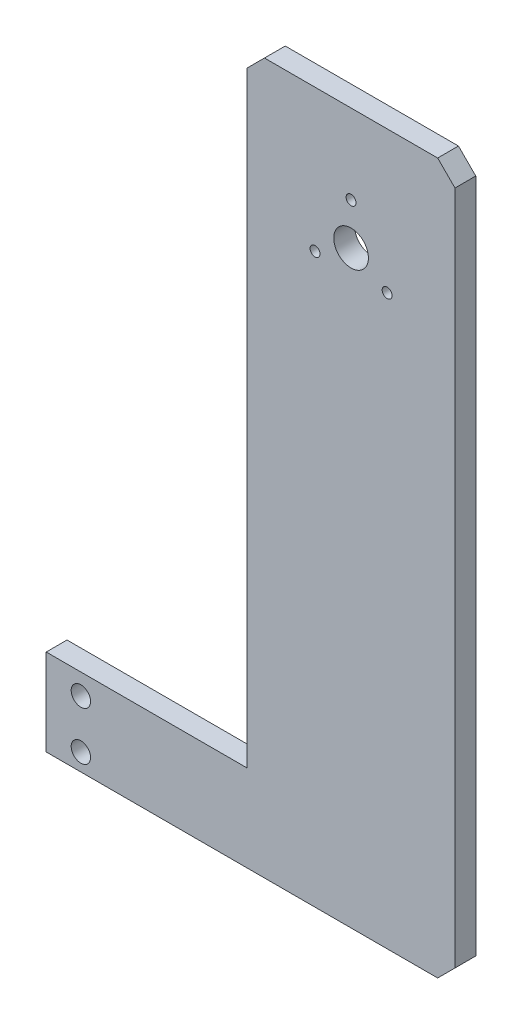
ISO-10303-21;
HEADER;
FILE_DESCRIPTION(('STEP AP214'),'2;1');
FILE_NAME('part.step','',(''),(''),'','','');
FILE_SCHEMA(('AUTOMOTIVE_DESIGN { 1 0 10303 214 1 1 1 1 }'));
ENDSEC;
DATA;
#1=APPLICATION_CONTEXT('core data for automotive mechanical design processes');
#2=APPLICATION_PROTOCOL_DEFINITION('international standard','automotive_design',2000,#1);
#3=PRODUCT_CONTEXT('',#1,'mechanical');
#4=PRODUCT('Part','Part','',(#3));
#5=PRODUCT_RELATED_PRODUCT_CATEGORY('part','',(#4));
#6=PRODUCT_DEFINITION_FORMATION('','',#4);
#7=PRODUCT_DEFINITION_CONTEXT('part definition',#1,'design');
#8=PRODUCT_DEFINITION('design','',#6,#7);
#9=PRODUCT_DEFINITION_SHAPE('','',#8);
#10=(LENGTH_UNIT() NAMED_UNIT(*) SI_UNIT(.MILLI.,.METRE.));
#11=(NAMED_UNIT(*) PLANE_ANGLE_UNIT() SI_UNIT($,.RADIAN.));
#12=(NAMED_UNIT(*) SI_UNIT($,.STERADIAN.) SOLID_ANGLE_UNIT());
#13=UNCERTAINTY_MEASURE_WITH_UNIT(LENGTH_MEASURE(1.E-05),#10,'distance_accuracy_value','');
#14=(GEOMETRIC_REPRESENTATION_CONTEXT(3) GLOBAL_UNCERTAINTY_ASSIGNED_CONTEXT((#13)) GLOBAL_UNIT_ASSIGNED_CONTEXT((#10,
#11,#12)) REPRESENTATION_CONTEXT('',''));
#15=CARTESIAN_POINT('',(0.,0.,0.));
#16=DIRECTION('',(0.,0.,1.));
#17=DIRECTION('',(1.,0.,0.));
#18=AXIS2_PLACEMENT_3D('',#15,#16,#17);
#19=CARTESIAN_POINT('',(0.,5.,6.));
#20=DIRECTION('',(-0.707106781186547,0.707106781186547,0.));
#21=DIRECTION('',(-0.707106781186548,-0.707106781186548,0.));
#22=AXIS2_PLACEMENT_3D('',#19,#20,#21);
#23=PLANE('',#22);
#24=DIRECTION('',(0.707106781186548,0.707106781186548,0.));
#25=VECTOR('',#24,1.);
#26=CARTESIAN_POINT('',(0.,5.,0.));
#27=LINE('',#26,#25);
#28=CARTESIAN_POINT('',(-5.,0.,0.));
#29=VERTEX_POINT('',#28);
#30=CARTESIAN_POINT('',(0.,5.,0.));
#31=VERTEX_POINT('',#30);
#32=EDGE_CURVE('E135',#29,#31,#27,.T.);
#33=ORIENTED_EDGE('',*,*,#32,.T.);
#34=DIRECTION('',(0.,0.,-1.));
#35=VECTOR('',#34,1.);
#36=CARTESIAN_POINT('',(0.,5.,6.));
#37=LINE('',#36,#35);
#38=CARTESIAN_POINT('',(0.,5.,6.));
#39=VERTEX_POINT('',#38);
#40=EDGE_CURVE('E11',#39,#31,#37,.T.);
#41=ORIENTED_EDGE('',*,*,#40,.F.);
#42=DIRECTION('',(0.707106781186548,0.707106781186548,0.));
#43=VECTOR('',#42,1.);
#44=CARTESIAN_POINT('',(0.,5.,6.));
#45=LINE('',#44,#43);
#46=CARTESIAN_POINT('',(-5.,0.,6.));
#47=VERTEX_POINT('',#46);
#48=EDGE_CURVE('E152',#47,#39,#45,.T.);
#49=ORIENTED_EDGE('',*,*,#48,.F.);
#50=DIRECTION('',(0.,0.,-1.));
#51=VECTOR('',#50,1.);
#52=CARTESIAN_POINT('',(-5.,0.,6.));
#53=LINE('',#52,#51);
#54=EDGE_CURVE('E131',#47,#29,#53,.T.);
#55=ORIENTED_EDGE('',*,*,#54,.T.);
#56=EDGE_LOOP('',(#33,#41,#49,#55));
#57=FACE_BOUND('',#56,.T.);
#58=ADVANCED_FACE('F33',(#57),#23,.F.);
#59=CARTESIAN_POINT('',(0.,200.,6.));
#60=DIRECTION('',(-1.,0.,0.));
#61=DIRECTION('',(0.,0.,1.));
#62=AXIS2_PLACEMENT_3D('',#59,#60,#61);
#63=PLANE('',#62);
#64=DIRECTION('',(0.,1.,0.));
#65=VECTOR('',#64,1.);
#66=CARTESIAN_POINT('',(0.,200.,0.));
#67=LINE('',#66,#65);
#68=CARTESIAN_POINT('',(0.,200.,0.));
#69=VERTEX_POINT('',#68);
#70=EDGE_CURVE('E138',#31,#69,#67,.T.);
#71=ORIENTED_EDGE('',*,*,#70,.T.);
#72=DIRECTION('',(0.,0.,-1.));
#73=VECTOR('',#72,1.);
#74=CARTESIAN_POINT('',(0.,200.,6.));
#75=LINE('',#74,#73);
#76=CARTESIAN_POINT('',(0.,200.,6.));
#77=VERTEX_POINT('',#76);
#78=EDGE_CURVE('E41',#77,#69,#75,.T.);
#79=ORIENTED_EDGE('',*,*,#78,.F.);
#80=DIRECTION('',(0.,1.,0.));
#81=VECTOR('',#80,1.);
#82=CARTESIAN_POINT('',(0.,200.,6.));
#83=LINE('',#82,#81);
#84=EDGE_CURVE('E95',#39,#77,#83,.T.);
#85=ORIENTED_EDGE('',*,*,#84,.F.);
#86=ORIENTED_EDGE('',*,*,#40,.T.);
#87=EDGE_LOOP('',(#71,#79,#85,#86));
#88=FACE_BOUND('',#87,.T.);
#89=ADVANCED_FACE('F263',(#88),#63,.F.);
#90=CARTESIAN_POINT('',(-5.,205.,6.));
#91=DIRECTION('',(-0.707106781186548,-0.707106781186547,0.));
#92=DIRECTION('',(0.707106781186547,-0.707106781186548,0.));
#93=AXIS2_PLACEMENT_3D('',#90,#91,#92);
#94=PLANE('',#93);
#95=DIRECTION('',(-0.707106781186547,0.707106781186548,0.));
#96=VECTOR('',#95,1.);
#97=CARTESIAN_POINT('',(-5.,205.,0.));
#98=LINE('',#97,#96);
#99=CARTESIAN_POINT('',(-5.,205.,0.));
#100=VERTEX_POINT('',#99);
#101=EDGE_CURVE('E141',#69,#100,#98,.T.);
#102=ORIENTED_EDGE('',*,*,#101,.T.);
#103=DIRECTION('',(0.,0.,-1.));
#104=VECTOR('',#103,1.);
#105=CARTESIAN_POINT('',(-5.,205.,6.));
#106=LINE('',#105,#104);
#107=CARTESIAN_POINT('',(-5.,205.,6.));
#108=VERTEX_POINT('',#107);
#109=EDGE_CURVE('E162',#108,#100,#106,.T.);
#110=ORIENTED_EDGE('',*,*,#109,.F.);
#111=DIRECTION('',(-0.707106781186547,0.707106781186548,0.));
#112=VECTOR('',#111,1.);
#113=CARTESIAN_POINT('',(-5.,205.,6.));
#114=LINE('',#113,#112);
#115=EDGE_CURVE('E170',#77,#108,#114,.T.);
#116=ORIENTED_EDGE('',*,*,#115,.F.);
#117=ORIENTED_EDGE('',*,*,#78,.T.);
#118=EDGE_LOOP('',(#102,#110,#116,#117));
#119=FACE_BOUND('',#118,.T.);
#120=ADVANCED_FACE('F168',(#119),#94,.F.);
#121=CARTESIAN_POINT('',(-55.,205.,6.));
#122=DIRECTION('',(0.,-1.,0.));
#123=DIRECTION('',(0.,0.,-1.));
#124=AXIS2_PLACEMENT_3D('',#121,#122,#123);
#125=PLANE('',#124);
#126=DIRECTION('',(-1.,0.,0.));
#127=VECTOR('',#126,1.);
#128=CARTESIAN_POINT('',(-55.,205.,0.));
#129=LINE('',#128,#127);
#130=CARTESIAN_POINT('',(-55.,205.,0.));
#131=VERTEX_POINT('',#130);
#132=EDGE_CURVE('E143',#100,#131,#129,.T.);
#133=ORIENTED_EDGE('',*,*,#132,.T.);
#134=DIRECTION('',(0.,0.,-1.));
#135=VECTOR('',#134,1.);
#136=CARTESIAN_POINT('',(-55.,205.,6.));
#137=LINE('',#136,#135);
#138=CARTESIAN_POINT('',(-55.,205.,6.));
#139=VERTEX_POINT('',#138);
#140=EDGE_CURVE('E159',#139,#131,#137,.T.);
#141=ORIENTED_EDGE('',*,*,#140,.F.);
#142=DIRECTION('',(-1.,0.,0.));
#143=VECTOR('',#142,1.);
#144=CARTESIAN_POINT('',(-55.,205.,6.));
#145=LINE('',#144,#143);
#146=EDGE_CURVE('E186',#108,#139,#145,.T.);
#147=ORIENTED_EDGE('',*,*,#146,.F.);
#148=ORIENTED_EDGE('',*,*,#109,.T.);
#149=EDGE_LOOP('',(#133,#141,#147,#148));
#150=FACE_BOUND('',#149,.T.);
#151=ADVANCED_FACE('F179',(#150),#125,.F.);
#152=CARTESIAN_POINT('',(-60.,200.,6.));
#153=DIRECTION('',(0.707106781186548,-0.707106781186547,0.));
#154=DIRECTION('',(0.707106781186547,0.707106781186548,0.));
#155=AXIS2_PLACEMENT_3D('',#152,#153,#154);
#156=PLANE('',#155);
#157=DIRECTION('',(-0.707106781186547,-0.707106781186548,0.));
#158=VECTOR('',#157,1.);
#159=CARTESIAN_POINT('',(-60.,200.,0.));
#160=LINE('',#159,#158);
#161=CARTESIAN_POINT('',(-60.,200.,0.));
#162=VERTEX_POINT('',#161);
#163=EDGE_CURVE('E145',#131,#162,#160,.T.);
#164=ORIENTED_EDGE('',*,*,#163,.T.);
#165=DIRECTION('',(0.,0.,-1.));
#166=VECTOR('',#165,1.);
#167=CARTESIAN_POINT('',(-60.,200.,6.));
#168=LINE('',#167,#166);
#169=CARTESIAN_POINT('',(-60.,200.,6.));
#170=VERTEX_POINT('',#169);
#171=EDGE_CURVE('E156',#170,#162,#168,.T.);
#172=ORIENTED_EDGE('',*,*,#171,.F.);
#173=DIRECTION('',(-0.707106781186547,-0.707106781186548,0.));
#174=VECTOR('',#173,1.);
#175=CARTESIAN_POINT('',(-60.,200.,6.));
#176=LINE('',#175,#174);
#177=EDGE_CURVE('E185',#139,#170,#176,.T.);
#178=ORIENTED_EDGE('',*,*,#177,.F.);
#179=ORIENTED_EDGE('',*,*,#140,.T.);
#180=EDGE_LOOP('',(#164,#172,#178,#179));
#181=FACE_BOUND('',#180,.T.);
#182=ADVANCED_FACE('F183',(#181),#156,.F.);
#183=CARTESIAN_POINT('',(-60.,25.,6.));
#184=DIRECTION('',(1.,0.,0.));
#185=DIRECTION('',(0.,0.,-1.));
#186=AXIS2_PLACEMENT_3D('',#183,#184,#185);
#187=PLANE('',#186);
#188=DIRECTION('',(0.,-1.,0.));
#189=VECTOR('',#188,1.);
#190=CARTESIAN_POINT('',(-60.,25.,0.));
#191=LINE('',#190,#189);
#192=CARTESIAN_POINT('',(-60.,25.,0.));
#193=VERTEX_POINT('',#192);
#194=EDGE_CURVE('E147',#162,#193,#191,.T.);
#195=ORIENTED_EDGE('',*,*,#194,.T.);
#196=DIRECTION('',(0.,0.,-1.));
#197=VECTOR('',#196,1.);
#198=CARTESIAN_POINT('',(-60.,25.,6.));
#199=LINE('',#198,#197);
#200=CARTESIAN_POINT('',(-60.,25.,6.));
#201=VERTEX_POINT('',#200);
#202=EDGE_CURVE('E126',#201,#193,#199,.T.);
#203=ORIENTED_EDGE('',*,*,#202,.F.);
#204=DIRECTION('',(0.,-1.,0.));
#205=VECTOR('',#204,1.);
#206=CARTESIAN_POINT('',(-60.,25.,6.));
#207=LINE('',#206,#205);
#208=EDGE_CURVE('E117',#170,#201,#207,.T.);
#209=ORIENTED_EDGE('',*,*,#208,.F.);
#210=ORIENTED_EDGE('',*,*,#171,.T.);
#211=EDGE_LOOP('',(#195,#203,#209,#210));
#212=FACE_BOUND('',#211,.T.);
#213=ADVANCED_FACE('F271',(#212),#187,.F.);
#214=CARTESIAN_POINT('',(-118.,25.,6.));
#215=DIRECTION('',(0.,-1.,0.));
#216=DIRECTION('',(0.,0.,-1.));
#217=AXIS2_PLACEMENT_3D('',#214,#215,#216);
#218=PLANE('',#217);
#219=DIRECTION('',(-1.,0.,0.));
#220=VECTOR('',#219,1.);
#221=CARTESIAN_POINT('',(-118.,25.,0.));
#222=LINE('',#221,#220);
#223=CARTESIAN_POINT('',(-118.,25.,0.));
#224=VERTEX_POINT('',#223);
#225=EDGE_CURVE('E125',#193,#224,#222,.T.);
#226=ORIENTED_EDGE('',*,*,#225,.T.);
#227=DIRECTION('',(0.,0.,-1.));
#228=VECTOR('',#227,1.);
#229=CARTESIAN_POINT('',(-118.,25.,6.));
#230=LINE('',#229,#228);
#231=CARTESIAN_POINT('',(-118.,25.,6.));
#232=VERTEX_POINT('',#231);
#233=EDGE_CURVE('E122',#232,#224,#230,.T.);
#234=ORIENTED_EDGE('',*,*,#233,.F.);
#235=DIRECTION('',(-1.,0.,0.));
#236=VECTOR('',#235,1.);
#237=CARTESIAN_POINT('',(-118.,25.,6.));
#238=LINE('',#237,#236);
#239=EDGE_CURVE('E111',#201,#232,#238,.T.);
#240=ORIENTED_EDGE('',*,*,#239,.F.);
#241=ORIENTED_EDGE('',*,*,#202,.T.);
#242=EDGE_LOOP('',(#226,#234,#240,#241));
#243=FACE_BOUND('',#242,.T.);
#244=ADVANCED_FACE('F123',(#243),#218,.F.);
#245=CARTESIAN_POINT('',(-118.,0.,6.));
#246=DIRECTION('',(1.,0.,0.));
#247=DIRECTION('',(0.,0.,-1.));
#248=AXIS2_PLACEMENT_3D('',#245,#246,#247);
#249=PLANE('',#248);
#250=DIRECTION('',(0.,-1.,0.));
#251=VECTOR('',#250,1.);
#252=CARTESIAN_POINT('',(-118.,0.,0.));
#253=LINE('',#252,#251);
#254=CARTESIAN_POINT('',(-118.,0.,0.));
#255=VERTEX_POINT('',#254);
#256=EDGE_CURVE('E81',#224,#255,#253,.T.);
#257=ORIENTED_EDGE('',*,*,#256,.T.);
#258=DIRECTION('',(0.,0.,-1.));
#259=VECTOR('',#258,1.);
#260=CARTESIAN_POINT('',(-118.,0.,6.));
#261=LINE('',#260,#259);
#262=CARTESIAN_POINT('',(-118.,0.,6.));
#263=VERTEX_POINT('',#262);
#264=EDGE_CURVE('E127',#263,#255,#261,.T.);
#265=ORIENTED_EDGE('',*,*,#264,.F.);
#266=DIRECTION('',(0.,-1.,0.));
#267=VECTOR('',#266,1.);
#268=CARTESIAN_POINT('',(-118.,0.,6.));
#269=LINE('',#268,#267);
#270=EDGE_CURVE('E115',#232,#263,#269,.T.);
#271=ORIENTED_EDGE('',*,*,#270,.F.);
#272=ORIENTED_EDGE('',*,*,#233,.T.);
#273=EDGE_LOOP('',(#257,#265,#271,#272));
#274=FACE_BOUND('',#273,.T.);
#275=ADVANCED_FACE('F129',(#274),#249,.F.);
#276=CARTESIAN_POINT('',(-5.,0.,6.));
#277=DIRECTION('',(0.,1.,0.));
#278=DIRECTION('',(-1.,0.,0.));
#279=AXIS2_PLACEMENT_3D('',#276,#277,#278);
#280=PLANE('',#279);
#281=DIRECTION('',(1.,0.,0.));
#282=VECTOR('',#281,1.);
#283=CARTESIAN_POINT('',(-5.,0.,0.));
#284=LINE('',#283,#282);
#285=EDGE_CURVE('E87',#255,#29,#284,.T.);
#286=ORIENTED_EDGE('',*,*,#285,.T.);
#287=ORIENTED_EDGE('',*,*,#54,.F.);
#288=DIRECTION('',(1.,0.,0.));
#289=VECTOR('',#288,1.);
#290=CARTESIAN_POINT('',(-5.,0.,6.));
#291=LINE('',#290,#289);
#292=EDGE_CURVE('E49',#263,#47,#291,.T.);
#293=ORIENTED_EDGE('',*,*,#292,.F.);
#294=ORIENTED_EDGE('',*,*,#264,.T.);
#295=EDGE_LOOP('',(#286,#287,#293,#294));
#296=FACE_BOUND('',#295,.T.);
#297=ADVANCED_FACE('F241',(#296),#280,.F.);
#298=CARTESIAN_POINT('',(0.,0.,6.));
#299=DIRECTION('',(0.,0.,1.));
#300=DIRECTION('',(1.,0.,0.));
#301=AXIS2_PLACEMENT_3D('',#298,#299,#300);
#302=PLANE('',#301);
#303=CARTESIAN_POINT('',(-30.,182.008885599144,6.));
#304=DIRECTION('',(0.,0.,1.));
#305=DIRECTION('',(1.,0.,0.));
#306=AXIS2_PLACEMENT_3D('',#303,#304,#305);
#307=CIRCLE('',#306,1.43);
#308=CARTESIAN_POINT('',(-28.57,182.008885599144,6.));
#309=VERTEX_POINT('',#308);
#310=EDGE_CURVE('E199',#309,#309,#307,.T.);
#311=ORIENTED_EDGE('',*,*,#310,.F.);
#312=EDGE_LOOP('',(#311));
#313=FACE_BOUND('',#312,.T.);
#314=CARTESIAN_POINT('',(-108.,4.99999999999999,6.));
#315=DIRECTION('',(0.,0.,1.));
#316=DIRECTION('',(1.,0.,0.));
#317=AXIS2_PLACEMENT_3D('',#314,#315,#316);
#318=CIRCLE('',#317,2.79999999999999);
#319=CARTESIAN_POINT('',(-105.2,4.99999999999999,6.));
#320=VERTEX_POINT('',#319);
#321=EDGE_CURVE('E213',#320,#320,#318,.T.);
#322=ORIENTED_EDGE('',*,*,#321,.F.);
#323=EDGE_LOOP('',(#322));
#324=FACE_BOUND('',#323,.T.);
#325=CARTESIAN_POINT('',(-30.,170.,6.));
#326=DIRECTION('',(0.,0.,1.));
#327=DIRECTION('',(1.,0.,0.));
#328=AXIS2_PLACEMENT_3D('',#325,#326,#327);
#329=CIRCLE('',#328,5.);
#330=CARTESIAN_POINT('',(-25.,170.,6.));
#331=VERTEX_POINT('',#330);
#332=EDGE_CURVE('E206',#331,#331,#329,.T.);
#333=ORIENTED_EDGE('',*,*,#332,.F.);
#334=EDGE_LOOP('',(#333));
#335=FACE_BOUND('',#334,.T.);
#336=CARTESIAN_POINT('',(-19.6,163.995557200428,6.));
#337=DIRECTION('',(0.,0.,1.));
#338=DIRECTION('',(1.,0.,0.));
#339=AXIS2_PLACEMENT_3D('',#336,#337,#338);
#340=CIRCLE('',#339,1.43);
#341=CARTESIAN_POINT('',(-18.17,163.995557200428,6.));
#342=VERTEX_POINT('',#341);
#343=EDGE_CURVE('E223',#342,#342,#340,.T.);
#344=ORIENTED_EDGE('',*,*,#343,.F.);
#345=EDGE_LOOP('',(#344));
#346=FACE_BOUND('',#345,.T.);
#347=CARTESIAN_POINT('',(-40.4,163.995557200428,6.));
#348=DIRECTION('',(0.,0.,1.));
#349=DIRECTION('',(1.,0.,0.));
#350=AXIS2_PLACEMENT_3D('',#347,#348,#349);
#351=CIRCLE('',#350,1.43);
#352=CARTESIAN_POINT('',(-38.97,163.995557200428,6.));
#353=VERTEX_POINT('',#352);
#354=EDGE_CURVE('E205',#353,#353,#351,.T.);
#355=ORIENTED_EDGE('',*,*,#354,.F.);
#356=EDGE_LOOP('',(#355));
#357=FACE_BOUND('',#356,.T.);
#358=CARTESIAN_POINT('',(-108.,19.,6.));
#359=DIRECTION('',(0.,0.,1.));
#360=DIRECTION('',(1.,0.,0.));
#361=AXIS2_PLACEMENT_3D('',#358,#359,#360);
#362=CIRCLE('',#361,2.79999999999999);
#363=CARTESIAN_POINT('',(-105.2,19.,6.));
#364=VERTEX_POINT('',#363);
#365=EDGE_CURVE('E193',#364,#364,#362,.T.);
#366=ORIENTED_EDGE('',*,*,#365,.F.);
#367=EDGE_LOOP('',(#366));
#368=FACE_BOUND('',#367,.T.);
#369=ORIENTED_EDGE('',*,*,#48,.T.);
#370=ORIENTED_EDGE('',*,*,#84,.T.);
#371=ORIENTED_EDGE('',*,*,#115,.T.);
#372=ORIENTED_EDGE('',*,*,#146,.T.);
#373=ORIENTED_EDGE('',*,*,#177,.T.);
#374=ORIENTED_EDGE('',*,*,#208,.T.);
#375=ORIENTED_EDGE('',*,*,#239,.T.);
#376=ORIENTED_EDGE('',*,*,#270,.T.);
#377=ORIENTED_EDGE('',*,*,#292,.T.);
#378=EDGE_LOOP('',(#369,#370,#371,#372,#373,#374,#375,#376,#377));
#379=FACE_BOUND('',#378,.T.);
#380=ADVANCED_FACE('F113',(#313,#324,#335,#346,#357,#368,#379),#302,.T.);
#381=CARTESIAN_POINT('',(0.,0.,0.));
#382=DIRECTION('',(0.,0.,1.));
#383=DIRECTION('',(1.,0.,0.));
#384=AXIS2_PLACEMENT_3D('',#381,#382,#383);
#385=PLANE('',#384);
#386=CARTESIAN_POINT('',(-30.,182.008885599144,0.));
#387=DIRECTION('',(0.,0.,1.));
#388=DIRECTION('',(1.,0.,0.));
#389=AXIS2_PLACEMENT_3D('',#386,#387,#388);
#390=CIRCLE('',#389,1.43);
#391=CARTESIAN_POINT('',(-28.57,182.008885599144,0.));
#392=VERTEX_POINT('',#391);
#393=EDGE_CURVE('E202',#392,#392,#390,.T.);
#394=ORIENTED_EDGE('',*,*,#393,.T.);
#395=EDGE_LOOP('',(#394));
#396=FACE_BOUND('',#395,.T.);
#397=CARTESIAN_POINT('',(-108.,4.99999999999999,0.));
#398=DIRECTION('',(0.,0.,1.));
#399=DIRECTION('',(1.,0.,0.));
#400=AXIS2_PLACEMENT_3D('',#397,#398,#399);
#401=CIRCLE('',#400,2.79999999999999);
#402=CARTESIAN_POINT('',(-105.2,4.99999999999999,0.));
#403=VERTEX_POINT('',#402);
#404=EDGE_CURVE('E196',#403,#403,#401,.T.);
#405=ORIENTED_EDGE('',*,*,#404,.T.);
#406=EDGE_LOOP('',(#405));
#407=FACE_BOUND('',#406,.T.);
#408=CARTESIAN_POINT('',(-30.,170.,0.));
#409=DIRECTION('',(0.,0.,1.));
#410=DIRECTION('',(1.,0.,0.));
#411=AXIS2_PLACEMENT_3D('',#408,#409,#410);
#412=CIRCLE('',#411,5.);
#413=CARTESIAN_POINT('',(-25.,170.,0.));
#414=VERTEX_POINT('',#413);
#415=EDGE_CURVE('E209',#414,#414,#412,.T.);
#416=ORIENTED_EDGE('',*,*,#415,.T.);
#417=EDGE_LOOP('',(#416));
#418=FACE_BOUND('',#417,.T.);
#419=CARTESIAN_POINT('',(-19.6,163.995557200428,0.));
#420=DIRECTION('',(0.,0.,1.));
#421=DIRECTION('',(1.,0.,0.));
#422=AXIS2_PLACEMENT_3D('',#419,#420,#421);
#423=CIRCLE('',#422,1.43);
#424=CARTESIAN_POINT('',(-18.17,163.995557200428,0.));
#425=VERTEX_POINT('',#424);
#426=EDGE_CURVE('E210',#425,#425,#423,.T.);
#427=ORIENTED_EDGE('',*,*,#426,.T.);
#428=EDGE_LOOP('',(#427));
#429=FACE_BOUND('',#428,.T.);
#430=CARTESIAN_POINT('',(-40.4,163.995557200428,0.));
#431=DIRECTION('',(0.,0.,1.));
#432=DIRECTION('',(1.,0.,0.));
#433=AXIS2_PLACEMENT_3D('',#430,#431,#432);
#434=CIRCLE('',#433,1.43);
#435=CARTESIAN_POINT('',(-38.97,163.995557200428,0.));
#436=VERTEX_POINT('',#435);
#437=EDGE_CURVE('E220',#436,#436,#434,.T.);
#438=ORIENTED_EDGE('',*,*,#437,.T.);
#439=EDGE_LOOP('',(#438));
#440=FACE_BOUND('',#439,.T.);
#441=CARTESIAN_POINT('',(-108.,19.,0.));
#442=DIRECTION('',(0.,0.,1.));
#443=DIRECTION('',(1.,0.,0.));
#444=AXIS2_PLACEMENT_3D('',#441,#442,#443);
#445=CIRCLE('',#444,2.79999999999999);
#446=CARTESIAN_POINT('',(-105.2,19.,0.));
#447=VERTEX_POINT('',#446);
#448=EDGE_CURVE('E139',#447,#447,#445,.T.);
#449=ORIENTED_EDGE('',*,*,#448,.T.);
#450=EDGE_LOOP('',(#449));
#451=FACE_BOUND('',#450,.T.);
#452=ORIENTED_EDGE('',*,*,#32,.F.);
#453=ORIENTED_EDGE('',*,*,#285,.F.);
#454=ORIENTED_EDGE('',*,*,#256,.F.);
#455=ORIENTED_EDGE('',*,*,#225,.F.);
#456=ORIENTED_EDGE('',*,*,#194,.F.);
#457=ORIENTED_EDGE('',*,*,#163,.F.);
#458=ORIENTED_EDGE('',*,*,#132,.F.);
#459=ORIENTED_EDGE('',*,*,#101,.F.);
#460=ORIENTED_EDGE('',*,*,#70,.F.);
#461=EDGE_LOOP('',(#452,#453,#454,#455,#456,#457,#458,#459,#460));
#462=FACE_BOUND('',#461,.T.);
#463=ADVANCED_FACE('F174',(#396,#407,#418,#429,#440,#451,#462),#385,.F.);
#464=CARTESIAN_POINT('',(-108.,19.,0.));
#465=DIRECTION('',(0.,0.,1.));
#466=DIRECTION('',(1.,0.,0.));
#467=AXIS2_PLACEMENT_3D('',#464,#465,#466);
#468=CYLINDRICAL_SURFACE('',#467,2.79999999999999);
#469=ORIENTED_EDGE('',*,*,#448,.F.);
#470=EDGE_LOOP('',(#469));
#471=FACE_BOUND('',#470,.T.);
#472=ORIENTED_EDGE('',*,*,#365,.T.);
#473=EDGE_LOOP('',(#472));
#474=FACE_BOUND('',#473,.T.);
#475=ADVANCED_FACE('F248',(#471,#474),#468,.F.);
#476=CARTESIAN_POINT('',(-40.4,163.995557200428,0.));
#477=DIRECTION('',(0.,0.,1.));
#478=DIRECTION('',(1.,0.,0.));
#479=AXIS2_PLACEMENT_3D('',#476,#477,#478);
#480=CYLINDRICAL_SURFACE('',#479,1.43);
#481=ORIENTED_EDGE('',*,*,#437,.F.);
#482=EDGE_LOOP('',(#481));
#483=FACE_BOUND('',#482,.T.);
#484=ORIENTED_EDGE('',*,*,#354,.T.);
#485=EDGE_LOOP('',(#484));
#486=FACE_BOUND('',#485,.T.);
#487=ADVANCED_FACE('F235',(#483,#486),#480,.F.);
#488=CARTESIAN_POINT('',(-19.6,163.995557200428,0.));
#489=DIRECTION('',(0.,0.,1.));
#490=DIRECTION('',(1.,0.,0.));
#491=AXIS2_PLACEMENT_3D('',#488,#489,#490);
#492=CYLINDRICAL_SURFACE('',#491,1.43);
#493=ORIENTED_EDGE('',*,*,#426,.F.);
#494=EDGE_LOOP('',(#493));
#495=FACE_BOUND('',#494,.T.);
#496=ORIENTED_EDGE('',*,*,#343,.T.);
#497=EDGE_LOOP('',(#496));
#498=FACE_BOUND('',#497,.T.);
#499=ADVANCED_FACE('F231',(#495,#498),#492,.F.);
#500=CARTESIAN_POINT('',(-30.,170.,0.));
#501=DIRECTION('',(0.,0.,1.));
#502=DIRECTION('',(1.,0.,0.));
#503=AXIS2_PLACEMENT_3D('',#500,#501,#502);
#504=CYLINDRICAL_SURFACE('',#503,5.);
#505=ORIENTED_EDGE('',*,*,#415,.F.);
#506=EDGE_LOOP('',(#505));
#507=FACE_BOUND('',#506,.T.);
#508=ORIENTED_EDGE('',*,*,#332,.T.);
#509=EDGE_LOOP('',(#508));
#510=FACE_BOUND('',#509,.T.);
#511=ADVANCED_FACE('F234',(#507,#510),#504,.F.);
#512=CARTESIAN_POINT('',(-108.,4.99999999999999,0.));
#513=DIRECTION('',(0.,0.,1.));
#514=DIRECTION('',(1.,0.,0.));
#515=AXIS2_PLACEMENT_3D('',#512,#513,#514);
#516=CYLINDRICAL_SURFACE('',#515,2.79999999999999);
#517=ORIENTED_EDGE('',*,*,#404,.F.);
#518=EDGE_LOOP('',(#517));
#519=FACE_BOUND('',#518,.T.);
#520=ORIENTED_EDGE('',*,*,#321,.T.);
#521=EDGE_LOOP('',(#520));
#522=FACE_BOUND('',#521,.T.);
#523=ADVANCED_FACE('F359',(#519,#522),#516,.F.);
#524=CARTESIAN_POINT('',(-30.,182.008885599144,0.));
#525=DIRECTION('',(0.,0.,1.));
#526=DIRECTION('',(1.,0.,0.));
#527=AXIS2_PLACEMENT_3D('',#524,#525,#526);
#528=CYLINDRICAL_SURFACE('',#527,1.43);
#529=ORIENTED_EDGE('',*,*,#393,.F.);
#530=EDGE_LOOP('',(#529));
#531=FACE_BOUND('',#530,.T.);
#532=ORIENTED_EDGE('',*,*,#310,.T.);
#533=EDGE_LOOP('',(#532));
#534=FACE_BOUND('',#533,.T.);
#535=ADVANCED_FACE('F369',(#531,#534),#528,.F.);
#536=CLOSED_SHELL('',(#58,#89,#120,#151,#182,#213,#244,#275,#297,#380,#463,#475,#487,#499,#511,
#523,#535));
#537=MANIFOLD_SOLID_BREP('B2',#536);
#538=ADVANCED_BREP_SHAPE_REPRESENTATION('',(#18,#537),#14);
#539=SHAPE_DEFINITION_REPRESENTATION(#9,#538);
ENDSEC;
END-ISO-10303-21;
